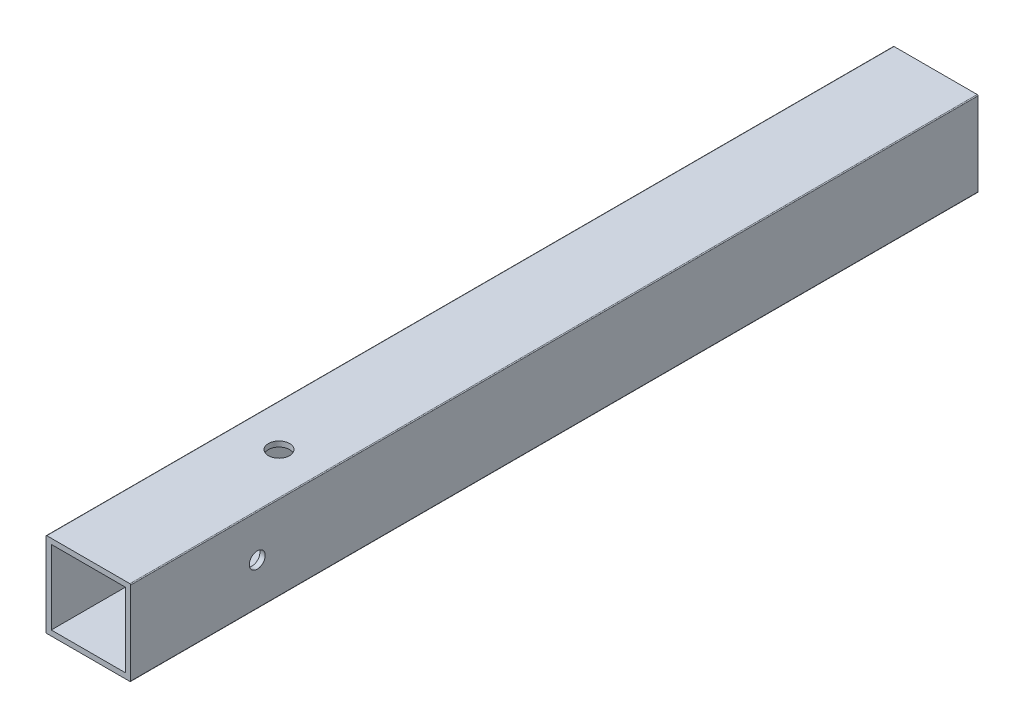
ISO-10303-21;
HEADER;
FILE_DESCRIPTION(('STEP AP214'),'2;1');
FILE_NAME('part.step','',(''),(''),'','','');
FILE_SCHEMA(('AUTOMOTIVE_DESIGN { 1 0 10303 214 1 1 1 1 }'));
ENDSEC;
DATA;
#1=APPLICATION_CONTEXT('core data for automotive mechanical design processes');
#2=APPLICATION_PROTOCOL_DEFINITION('international standard','automotive_design',2000,#1);
#3=PRODUCT_CONTEXT('',#1,'mechanical');
#4=PRODUCT('Part','Part','',(#3));
#5=PRODUCT_RELATED_PRODUCT_CATEGORY('part','',(#4));
#6=PRODUCT_DEFINITION_FORMATION('','',#4);
#7=PRODUCT_DEFINITION_CONTEXT('part definition',#1,'design');
#8=PRODUCT_DEFINITION('design','',#6,#7);
#9=PRODUCT_DEFINITION_SHAPE('','',#8);
#10=(LENGTH_UNIT() NAMED_UNIT(*) SI_UNIT(.MILLI.,.METRE.));
#11=(NAMED_UNIT(*) PLANE_ANGLE_UNIT() SI_UNIT($,.RADIAN.));
#12=(NAMED_UNIT(*) SI_UNIT($,.STERADIAN.) SOLID_ANGLE_UNIT());
#13=UNCERTAINTY_MEASURE_WITH_UNIT(LENGTH_MEASURE(1.E-05),#10,'distance_accuracy_value','');
#14=(GEOMETRIC_REPRESENTATION_CONTEXT(3) GLOBAL_UNCERTAINTY_ASSIGNED_CONTEXT((#13)) GLOBAL_UNIT_ASSIGNED_CONTEXT((#10,
#11,#12)) REPRESENTATION_CONTEXT('',''));
#15=CARTESIAN_POINT('',(0.,0.,0.));
#16=DIRECTION('',(0.,0.,1.));
#17=DIRECTION('',(1.,0.,0.));
#18=AXIS2_PLACEMENT_3D('',#15,#16,#17);
#19=CARTESIAN_POINT('',(-1.33350000000001,-1.3335,-254.));
#20=DIRECTION('',(0.,0.,1.));
#21=DIRECTION('',(-1.,0.,0.));
#22=AXIS2_PLACEMENT_3D('',#19,#20,#21);
#23=CYLINDRICAL_SURFACE('',#22,0.253999999999997);
#24=CARTESIAN_POINT('',(-1.33350000000001,-1.3335,0.));
#25=DIRECTION('',(0.,0.,-1.));
#26=DIRECTION('',(-1.,0.,0.));
#27=AXIS2_PLACEMENT_3D('',#24,#25,#26);
#28=CIRCLE('',#27,0.253999999999997);
#29=CARTESIAN_POINT('',(-1.33350000000001,-1.5875,0.));
#30=VERTEX_POINT('',#29);
#31=CARTESIAN_POINT('',(-1.5875,-1.3335,0.));
#32=VERTEX_POINT('',#31);
#33=EDGE_CURVE('E165',#30,#32,#28,.T.);
#34=ORIENTED_EDGE('',*,*,#33,.T.);
#35=DIRECTION('',(0.,0.,1.));
#36=VECTOR('',#35,1.);
#37=CARTESIAN_POINT('',(-1.5875,-1.3335,-254.));
#38=LINE('',#37,#36);
#39=CARTESIAN_POINT('',(-1.5875,-1.3335,-254.));
#40=VERTEX_POINT('',#39);
#41=EDGE_CURVE('E187',#40,#32,#38,.T.);
#42=ORIENTED_EDGE('',*,*,#41,.F.);
#43=CARTESIAN_POINT('',(-1.33350000000001,-1.3335,-254.));
#44=DIRECTION('',(0.,0.,-1.));
#45=DIRECTION('',(-1.,0.,0.));
#46=AXIS2_PLACEMENT_3D('',#43,#44,#45);
#47=CIRCLE('',#46,0.253999999999997);
#48=CARTESIAN_POINT('',(-1.33350000000001,-1.5875,-254.));
#49=VERTEX_POINT('',#48);
#50=EDGE_CURVE('E169',#49,#40,#47,.T.);
#51=ORIENTED_EDGE('',*,*,#50,.F.);
#52=DIRECTION('',(0.,0.,1.));
#53=VECTOR('',#52,1.);
#54=CARTESIAN_POINT('',(-1.33350000000001,-1.5875,-254.));
#55=LINE('',#54,#53);
#56=EDGE_CURVE('E11',#49,#30,#55,.T.);
#57=ORIENTED_EDGE('',*,*,#56,.T.);
#58=EDGE_LOOP('',(#34,#42,#51,#57));
#59=FACE_BOUND('',#58,.T.);
#60=ADVANCED_FACE('F39',(#59),#23,.T.);
#61=CARTESIAN_POINT('',(23.5585,-1.5875,-254.));
#62=DIRECTION('',(0.,-1.,0.));
#63=DIRECTION('',(1.,0.,0.));
#64=AXIS2_PLACEMENT_3D('',#61,#62,#63);
#65=PLANE('',#64);
#66=CARTESIAN_POINT('',(11.1125,-1.5875,-57.15));
#67=DIRECTION('',(0.,1.,0.));
#68=DIRECTION('',(1.,0.,0.));
#69=AXIS2_PLACEMENT_3D('',#66,#67,#68);
#70=CIRCLE('',#69,3.175);
#71=CARTESIAN_POINT('',(14.2875,-1.5875,-57.15));
#72=VERTEX_POINT('',#71);
#73=EDGE_CURVE('E233',#72,#72,#70,.T.);
#74=ORIENTED_EDGE('',*,*,#73,.T.);
#75=EDGE_LOOP('',(#74));
#76=FACE_BOUND('',#75,.T.);
#77=DIRECTION('',(-1.,0.,0.));
#78=VECTOR('',#77,1.);
#79=CARTESIAN_POINT('',(23.5585,-1.5875,0.));
#80=LINE('',#79,#78);
#81=CARTESIAN_POINT('',(23.5585,-1.5875,0.));
#82=VERTEX_POINT('',#81);
#83=EDGE_CURVE('E173',#82,#30,#80,.T.);
#84=ORIENTED_EDGE('',*,*,#83,.T.);
#85=ORIENTED_EDGE('',*,*,#56,.F.);
#86=DIRECTION('',(-1.,0.,0.));
#87=VECTOR('',#86,1.);
#88=CARTESIAN_POINT('',(23.5585,-1.5875,-254.));
#89=LINE('',#88,#87);
#90=CARTESIAN_POINT('',(23.5585,-1.5875,-254.));
#91=VERTEX_POINT('',#90);
#92=EDGE_CURVE('E185',#91,#49,#89,.T.);
#93=ORIENTED_EDGE('',*,*,#92,.F.);
#94=DIRECTION('',(0.,0.,1.));
#95=VECTOR('',#94,1.);
#96=CARTESIAN_POINT('',(23.5585,-1.5875,-254.));
#97=LINE('',#96,#95);
#98=EDGE_CURVE('E47',#91,#82,#97,.T.);
#99=ORIENTED_EDGE('',*,*,#98,.T.);
#100=EDGE_LOOP('',(#84,#85,#93,#99));
#101=FACE_BOUND('',#100,.T.);
#102=ADVANCED_FACE('F265',(#76,#101),#65,.T.);
#103=CARTESIAN_POINT('',(23.5585,-1.3335,-254.));
#104=DIRECTION('',(0.,0.,1.));
#105=DIRECTION('',(-1.,0.,0.));
#106=AXIS2_PLACEMENT_3D('',#103,#104,#105);
#107=CYLINDRICAL_SURFACE('',#106,0.253999999999998);
#108=CARTESIAN_POINT('',(23.5585,-1.3335,0.));
#109=DIRECTION('',(0.,0.,-1.));
#110=DIRECTION('',(-1.,0.,0.));
#111=AXIS2_PLACEMENT_3D('',#108,#109,#110);
#112=CIRCLE('',#111,0.253999999999998);
#113=CARTESIAN_POINT('',(23.8125,-1.3335,0.));
#114=VERTEX_POINT('',#113);
#115=EDGE_CURVE('E200',#114,#82,#112,.T.);
#116=ORIENTED_EDGE('',*,*,#115,.T.);
#117=ORIENTED_EDGE('',*,*,#98,.F.);
#118=CARTESIAN_POINT('',(23.5585,-1.3335,-254.));
#119=DIRECTION('',(0.,0.,-1.));
#120=DIRECTION('',(-1.,0.,0.));
#121=AXIS2_PLACEMENT_3D('',#118,#119,#120);
#122=CIRCLE('',#121,0.253999999999998);
#123=CARTESIAN_POINT('',(23.8125,-1.3335,-254.));
#124=VERTEX_POINT('',#123);
#125=EDGE_CURVE('E183',#124,#91,#122,.T.);
#126=ORIENTED_EDGE('',*,*,#125,.F.);
#127=DIRECTION('',(0.,0.,1.));
#128=VECTOR('',#127,1.);
#129=CARTESIAN_POINT('',(23.8125,-1.3335,-254.));
#130=LINE('',#129,#128);
#131=EDGE_CURVE('E205',#124,#114,#130,.T.);
#132=ORIENTED_EDGE('',*,*,#131,.T.);
#133=EDGE_LOOP('',(#116,#117,#126,#132));
#134=FACE_BOUND('',#133,.T.);
#135=ADVANCED_FACE('F270',(#134),#107,.T.);
#136=CARTESIAN_POINT('',(23.8125,23.5585,-254.));
#137=DIRECTION('',(1.,0.,0.));
#138=DIRECTION('',(0.,1.,0.));
#139=AXIS2_PLACEMENT_3D('',#136,#137,#138);
#140=PLANE('',#139);
#141=CARTESIAN_POINT('',(23.8125,11.1125,-37.933268304));
#142=DIRECTION('',(-1.,0.,0.));
#143=DIRECTION('',(0.,1.,0.));
#144=AXIS2_PLACEMENT_3D('',#141,#142,#143);
#145=CIRCLE('',#144,2.38125);
#146=CARTESIAN_POINT('',(23.8125,13.49375,-37.933268304));
#147=VERTEX_POINT('',#146);
#148=EDGE_CURVE('E228',#147,#147,#145,.T.);
#149=ORIENTED_EDGE('',*,*,#148,.T.);
#150=EDGE_LOOP('',(#149));
#151=FACE_BOUND('',#150,.T.);
#152=DIRECTION('',(0.,-1.,0.));
#153=VECTOR('',#152,1.);
#154=CARTESIAN_POINT('',(23.8125,23.5585,0.));
#155=LINE('',#154,#153);
#156=CARTESIAN_POINT('',(23.8125,23.5585,0.));
#157=VERTEX_POINT('',#156);
#158=EDGE_CURVE('E198',#157,#114,#155,.T.);
#159=ORIENTED_EDGE('',*,*,#158,.T.);
#160=ORIENTED_EDGE('',*,*,#131,.F.);
#161=DIRECTION('',(0.,-1.,0.));
#162=VECTOR('',#161,1.);
#163=CARTESIAN_POINT('',(23.8125,23.5585,-254.));
#164=LINE('',#163,#162);
#165=CARTESIAN_POINT('',(23.8125,23.5585,-254.));
#166=VERTEX_POINT('',#165);
#167=EDGE_CURVE('E181',#166,#124,#164,.T.);
#168=ORIENTED_EDGE('',*,*,#167,.F.);
#169=DIRECTION('',(0.,0.,1.));
#170=VECTOR('',#169,1.);
#171=CARTESIAN_POINT('',(23.8125,23.5585,-254.));
#172=LINE('',#171,#170);
#173=EDGE_CURVE('E208',#166,#157,#172,.T.);
#174=ORIENTED_EDGE('',*,*,#173,.T.);
#175=EDGE_LOOP('',(#159,#160,#168,#174));
#176=FACE_BOUND('',#175,.T.);
#177=ADVANCED_FACE('F296',(#151,#176),#140,.T.);
#178=CARTESIAN_POINT('',(23.5585,23.5585,-254.));
#179=DIRECTION('',(0.,0.,1.));
#180=DIRECTION('',(-1.,0.,0.));
#181=AXIS2_PLACEMENT_3D('',#178,#179,#180);
#182=CYLINDRICAL_SURFACE('',#181,0.254000000000001);
#183=CARTESIAN_POINT('',(23.5585,23.5585,0.));
#184=DIRECTION('',(0.,0.,-1.));
#185=DIRECTION('',(-1.,0.,0.));
#186=AXIS2_PLACEMENT_3D('',#183,#184,#185);
#187=CIRCLE('',#186,0.254000000000001);
#188=CARTESIAN_POINT('',(23.5585,23.8125,0.));
#189=VERTEX_POINT('',#188);
#190=EDGE_CURVE('E196',#189,#157,#187,.T.);
#191=ORIENTED_EDGE('',*,*,#190,.T.);
#192=ORIENTED_EDGE('',*,*,#173,.F.);
#193=CARTESIAN_POINT('',(23.5585,23.5585,-254.));
#194=DIRECTION('',(0.,0.,-1.));
#195=DIRECTION('',(-1.,0.,0.));
#196=AXIS2_PLACEMENT_3D('',#193,#194,#195);
#197=CIRCLE('',#196,0.254000000000001);
#198=CARTESIAN_POINT('',(23.5585,23.8125,-254.));
#199=VERTEX_POINT('',#198);
#200=EDGE_CURVE('E179',#199,#166,#197,.T.);
#201=ORIENTED_EDGE('',*,*,#200,.F.);
#202=DIRECTION('',(0.,0.,1.));
#203=VECTOR('',#202,1.);
#204=CARTESIAN_POINT('',(23.5585,23.8125,-254.));
#205=LINE('',#204,#203);
#206=EDGE_CURVE('E211',#199,#189,#205,.T.);
#207=ORIENTED_EDGE('',*,*,#206,.T.);
#208=EDGE_LOOP('',(#191,#192,#201,#207));
#209=FACE_BOUND('',#208,.T.);
#210=ADVANCED_FACE('F301',(#209),#182,.T.);
#211=CARTESIAN_POINT('',(-1.33350000000001,23.8125,-254.));
#212=DIRECTION('',(0.,1.,0.));
#213=DIRECTION('',(0.,0.,-1.));
#214=AXIS2_PLACEMENT_3D('',#211,#212,#213);
#215=PLANE('',#214);
#216=CARTESIAN_POINT('',(11.1125,23.8125,-57.15));
#217=DIRECTION('',(0.,-1.,0.));
#218=DIRECTION('',(0.,0.,-1.));
#219=AXIS2_PLACEMENT_3D('',#216,#217,#218);
#220=CIRCLE('',#219,3.175);
#221=CARTESIAN_POINT('',(11.1125,23.8125,-60.325));
#222=VERTEX_POINT('',#221);
#223=EDGE_CURVE('E241',#222,#222,#220,.T.);
#224=ORIENTED_EDGE('',*,*,#223,.T.);
#225=EDGE_LOOP('',(#224));
#226=FACE_BOUND('',#225,.T.);
#227=DIRECTION('',(1.,0.,0.));
#228=VECTOR('',#227,1.);
#229=CARTESIAN_POINT('',(-1.33350000000001,23.8125,0.));
#230=LINE('',#229,#228);
#231=CARTESIAN_POINT('',(-1.33350000000001,23.8125,0.));
#232=VERTEX_POINT('',#231);
#233=EDGE_CURVE('E194',#232,#189,#230,.T.);
#234=ORIENTED_EDGE('',*,*,#233,.T.);
#235=ORIENTED_EDGE('',*,*,#206,.F.);
#236=DIRECTION('',(1.,0.,0.));
#237=VECTOR('',#236,1.);
#238=CARTESIAN_POINT('',(-1.33350000000001,23.8125,-254.));
#239=LINE('',#238,#237);
#240=CARTESIAN_POINT('',(-1.33350000000001,23.8125,-254.));
#241=VERTEX_POINT('',#240);
#242=EDGE_CURVE('E177',#241,#199,#239,.T.);
#243=ORIENTED_EDGE('',*,*,#242,.F.);
#244=DIRECTION('',(0.,0.,1.));
#245=VECTOR('',#244,1.);
#246=CARTESIAN_POINT('',(-1.33350000000001,23.8125,-254.));
#247=LINE('',#246,#245);
#248=EDGE_CURVE('E214',#241,#232,#247,.T.);
#249=ORIENTED_EDGE('',*,*,#248,.T.);
#250=EDGE_LOOP('',(#234,#235,#243,#249));
#251=FACE_BOUND('',#250,.T.);
#252=ADVANCED_FACE('F305',(#226,#251),#215,.T.);
#253=CARTESIAN_POINT('',(-1.33350000000001,23.5585,-254.));
#254=DIRECTION('',(0.,0.,1.));
#255=DIRECTION('',(-1.,0.,0.));
#256=AXIS2_PLACEMENT_3D('',#253,#254,#255);
#257=CYLINDRICAL_SURFACE('',#256,0.253999999999992);
#258=CARTESIAN_POINT('',(-1.33350000000001,23.5585,0.));
#259=DIRECTION('',(0.,0.,-1.));
#260=DIRECTION('',(-1.,0.,0.));
#261=AXIS2_PLACEMENT_3D('',#258,#259,#260);
#262=CIRCLE('',#261,0.253999999999992);
#263=CARTESIAN_POINT('',(-1.5875,23.5585,0.));
#264=VERTEX_POINT('',#263);
#265=EDGE_CURVE('E192',#264,#232,#262,.T.);
#266=ORIENTED_EDGE('',*,*,#265,.T.);
#267=ORIENTED_EDGE('',*,*,#248,.F.);
#268=CARTESIAN_POINT('',(-1.33350000000001,23.5585,-254.));
#269=DIRECTION('',(0.,0.,-1.));
#270=DIRECTION('',(-1.,0.,0.));
#271=AXIS2_PLACEMENT_3D('',#268,#269,#270);
#272=CIRCLE('',#271,0.253999999999992);
#273=CARTESIAN_POINT('',(-1.5875,23.5585,-254.));
#274=VERTEX_POINT('',#273);
#275=EDGE_CURVE('E175',#274,#241,#272,.T.);
#276=ORIENTED_EDGE('',*,*,#275,.F.);
#277=DIRECTION('',(0.,0.,1.));
#278=VECTOR('',#277,1.);
#279=CARTESIAN_POINT('',(-1.5875,23.5585,-254.));
#280=LINE('',#279,#278);
#281=EDGE_CURVE('E217',#274,#264,#280,.T.);
#282=ORIENTED_EDGE('',*,*,#281,.T.);
#283=EDGE_LOOP('',(#266,#267,#276,#282));
#284=FACE_BOUND('',#283,.T.);
#285=ADVANCED_FACE('F308',(#284),#257,.T.);
#286=CARTESIAN_POINT('',(-1.5875,-1.3335,-254.));
#287=DIRECTION('',(-1.,0.,0.));
#288=DIRECTION('',(0.,-1.,0.));
#289=AXIS2_PLACEMENT_3D('',#286,#287,#288);
#290=PLANE('',#289);
#291=CARTESIAN_POINT('',(-1.58750000000001,11.1125,-37.933268304));
#292=DIRECTION('',(-1.,0.,0.));
#293=DIRECTION('',(0.,1.,0.));
#294=AXIS2_PLACEMENT_3D('',#291,#292,#293);
#295=CIRCLE('',#294,2.38125);
#296=CARTESIAN_POINT('',(-1.5875,13.49375,-37.933268304));
#297=VERTEX_POINT('',#296);
#298=EDGE_CURVE('E223',#297,#297,#295,.T.);
#299=ORIENTED_EDGE('',*,*,#298,.F.);
#300=EDGE_LOOP('',(#299));
#301=FACE_BOUND('',#300,.T.);
#302=DIRECTION('',(0.,1.,0.));
#303=VECTOR('',#302,1.);
#304=CARTESIAN_POINT('',(-1.5875,-1.3335,0.));
#305=LINE('',#304,#303);
#306=EDGE_CURVE('E190',#32,#264,#305,.T.);
#307=ORIENTED_EDGE('',*,*,#306,.T.);
#308=ORIENTED_EDGE('',*,*,#281,.F.);
#309=DIRECTION('',(0.,1.,0.));
#310=VECTOR('',#309,1.);
#311=CARTESIAN_POINT('',(-1.5875,-1.3335,-254.));
#312=LINE('',#311,#310);
#313=EDGE_CURVE('E172',#40,#274,#312,.T.);
#314=ORIENTED_EDGE('',*,*,#313,.F.);
#315=ORIENTED_EDGE('',*,*,#41,.T.);
#316=EDGE_LOOP('',(#307,#308,#314,#315));
#317=FACE_BOUND('',#316,.T.);
#318=ADVANCED_FACE('F285',(#301,#317),#290,.T.);
#319=CARTESIAN_POINT('',(-1.33350000000001,-1.3335,-254.));
#320=DIRECTION('',(0.,0.,1.));
#321=DIRECTION('',(-1.,0.,0.));
#322=AXIS2_PLACEMENT_3D('',#319,#320,#321);
#323=PLANE('',#322);
#324=DIRECTION('',(1.,0.,0.));
#325=VECTOR('',#324,1.);
#326=CARTESIAN_POINT('',(0.,22.225,-254.));
#327=LINE('',#326,#325);
#328=CARTESIAN_POINT('',(0.,22.225,-254.));
#329=VERTEX_POINT('',#328);
#330=CARTESIAN_POINT('',(22.225,22.225,-254.));
#331=VERTEX_POINT('',#330);
#332=EDGE_CURVE('E136',#329,#331,#327,.T.);
#333=ORIENTED_EDGE('',*,*,#332,.F.);
#334=DIRECTION('',(0.,1.,0.));
#335=VECTOR('',#334,1.);
#336=CARTESIAN_POINT('',(0.,22.225,-254.));
#337=LINE('',#336,#335);
#338=CARTESIAN_POINT('',(0.,0.,-254.));
#339=VERTEX_POINT('',#338);
#340=EDGE_CURVE('E149',#339,#329,#337,.T.);
#341=ORIENTED_EDGE('',*,*,#340,.F.);
#342=DIRECTION('',(-1.,0.,0.));
#343=VECTOR('',#342,1.);
#344=CARTESIAN_POINT('',(0.,0.,-254.));
#345=LINE('',#344,#343);
#346=CARTESIAN_POINT('',(22.225,0.,-254.));
#347=VERTEX_POINT('',#346);
#348=EDGE_CURVE('E131',#347,#339,#345,.T.);
#349=ORIENTED_EDGE('',*,*,#348,.F.);
#350=DIRECTION('',(0.,-1.,0.));
#351=VECTOR('',#350,1.);
#352=CARTESIAN_POINT('',(22.225,22.225,-254.));
#353=LINE('',#352,#351);
#354=EDGE_CURVE('E139',#331,#347,#353,.T.);
#355=ORIENTED_EDGE('',*,*,#354,.F.);
#356=EDGE_LOOP('',(#333,#341,#349,#355));
#357=FACE_BOUND('',#356,.T.);
#358=ORIENTED_EDGE('',*,*,#50,.T.);
#359=ORIENTED_EDGE('',*,*,#313,.T.);
#360=ORIENTED_EDGE('',*,*,#275,.T.);
#361=ORIENTED_EDGE('',*,*,#242,.T.);
#362=ORIENTED_EDGE('',*,*,#200,.T.);
#363=ORIENTED_EDGE('',*,*,#167,.T.);
#364=ORIENTED_EDGE('',*,*,#125,.T.);
#365=ORIENTED_EDGE('',*,*,#92,.T.);
#366=EDGE_LOOP('',(#358,#359,#360,#361,#362,#363,#364,#365));
#367=FACE_BOUND('',#366,.T.);
#368=ADVANCED_FACE('F147',(#357,#367),#323,.F.);
#369=CARTESIAN_POINT('',(-1.33350000000001,-1.3335,0.));
#370=DIRECTION('',(0.,0.,1.));
#371=DIRECTION('',(-1.,0.,0.));
#372=AXIS2_PLACEMENT_3D('',#369,#370,#371);
#373=PLANE('',#372);
#374=DIRECTION('',(0.,-1.,0.));
#375=VECTOR('',#374,1.);
#376=CARTESIAN_POINT('',(22.225,22.225,0.));
#377=LINE('',#376,#375);
#378=CARTESIAN_POINT('',(22.225,22.225,0.));
#379=VERTEX_POINT('',#378);
#380=CARTESIAN_POINT('',(22.225,0.,0.));
#381=VERTEX_POINT('',#380);
#382=EDGE_CURVE('E155',#379,#381,#377,.T.);
#383=ORIENTED_EDGE('',*,*,#382,.T.);
#384=DIRECTION('',(-1.,0.,0.));
#385=VECTOR('',#384,1.);
#386=CARTESIAN_POINT('',(0.,0.,0.));
#387=LINE('',#386,#385);
#388=CARTESIAN_POINT('',(0.,0.,0.));
#389=VERTEX_POINT('',#388);
#390=EDGE_CURVE('E134',#381,#389,#387,.T.);
#391=ORIENTED_EDGE('',*,*,#390,.T.);
#392=DIRECTION('',(0.,1.,0.));
#393=VECTOR('',#392,1.);
#394=CARTESIAN_POINT('',(0.,22.225,0.));
#395=LINE('',#394,#393);
#396=CARTESIAN_POINT('',(0.,22.225,0.));
#397=VERTEX_POINT('',#396);
#398=EDGE_CURVE('E159',#389,#397,#395,.T.);
#399=ORIENTED_EDGE('',*,*,#398,.T.);
#400=DIRECTION('',(1.,0.,0.));
#401=VECTOR('',#400,1.);
#402=CARTESIAN_POINT('',(0.,22.225,0.));
#403=LINE('',#402,#401);
#404=EDGE_CURVE('E145',#397,#379,#403,.T.);
#405=ORIENTED_EDGE('',*,*,#404,.T.);
#406=EDGE_LOOP('',(#383,#391,#399,#405));
#407=FACE_BOUND('',#406,.T.);
#408=ORIENTED_EDGE('',*,*,#33,.F.);
#409=ORIENTED_EDGE('',*,*,#83,.F.);
#410=ORIENTED_EDGE('',*,*,#115,.F.);
#411=ORIENTED_EDGE('',*,*,#158,.F.);
#412=ORIENTED_EDGE('',*,*,#190,.F.);
#413=ORIENTED_EDGE('',*,*,#233,.F.);
#414=ORIENTED_EDGE('',*,*,#265,.F.);
#415=ORIENTED_EDGE('',*,*,#306,.F.);
#416=EDGE_LOOP('',(#408,#409,#410,#411,#412,#413,#414,#415));
#417=FACE_BOUND('',#416,.T.);
#418=ADVANCED_FACE('F279',(#407,#417),#373,.T.);
#419=CARTESIAN_POINT('',(22.225,22.225,-254.));
#420=DIRECTION('',(1.,0.,0.));
#421=DIRECTION('',(0.,1.,0.));
#422=AXIS2_PLACEMENT_3D('',#419,#420,#421);
#423=PLANE('',#422);
#424=CARTESIAN_POINT('',(22.225,11.1125,-37.933268304));
#425=DIRECTION('',(-1.,0.,0.));
#426=DIRECTION('',(0.,1.,0.));
#427=AXIS2_PLACEMENT_3D('',#424,#425,#426);
#428=CIRCLE('',#427,2.38125);
#429=CARTESIAN_POINT('',(22.225,13.49375,-37.933268304));
#430=VERTEX_POINT('',#429);
#431=EDGE_CURVE('E157',#430,#430,#428,.T.);
#432=ORIENTED_EDGE('',*,*,#431,.F.);
#433=EDGE_LOOP('',(#432));
#434=FACE_BOUND('',#433,.T.);
#435=ORIENTED_EDGE('',*,*,#382,.F.);
#436=DIRECTION('',(0.,0.,1.));
#437=VECTOR('',#436,1.);
#438=CARTESIAN_POINT('',(22.225,22.225,-254.));
#439=LINE('',#438,#437);
#440=EDGE_CURVE('E141',#331,#379,#439,.T.);
#441=ORIENTED_EDGE('',*,*,#440,.F.);
#442=ORIENTED_EDGE('',*,*,#354,.T.);
#443=DIRECTION('',(0.,0.,1.));
#444=VECTOR('',#443,1.);
#445=CARTESIAN_POINT('',(22.225,0.,-254.));
#446=LINE('',#445,#444);
#447=EDGE_CURVE('E63',#347,#381,#446,.T.);
#448=ORIENTED_EDGE('',*,*,#447,.T.);
#449=EDGE_LOOP('',(#435,#441,#442,#448));
#450=FACE_BOUND('',#449,.T.);
#451=ADVANCED_FACE('F140',(#434,#450),#423,.F.);
#452=CARTESIAN_POINT('',(0.,22.225,-254.));
#453=DIRECTION('',(0.,1.,0.));
#454=DIRECTION('',(-1.,0.,0.));
#455=AXIS2_PLACEMENT_3D('',#452,#453,#454);
#456=PLANE('',#455);
#457=CARTESIAN_POINT('',(11.1125,22.225,-57.15));
#458=DIRECTION('',(0.,-1.,0.));
#459=DIRECTION('',(-1.,0.,0.));
#460=AXIS2_PLACEMENT_3D('',#457,#458,#459);
#461=CIRCLE('',#460,3.175);
#462=CARTESIAN_POINT('',(7.9375,22.225,-57.15));
#463=VERTEX_POINT('',#462);
#464=EDGE_CURVE('E238',#463,#463,#461,.T.);
#465=ORIENTED_EDGE('',*,*,#464,.F.);
#466=EDGE_LOOP('',(#465));
#467=FACE_BOUND('',#466,.T.);
#468=ORIENTED_EDGE('',*,*,#404,.F.);
#469=DIRECTION('',(0.,0.,1.));
#470=VECTOR('',#469,1.);
#471=CARTESIAN_POINT('',(0.,22.225,-254.));
#472=LINE('',#471,#470);
#473=EDGE_CURVE('E166',#329,#397,#472,.T.);
#474=ORIENTED_EDGE('',*,*,#473,.F.);
#475=ORIENTED_EDGE('',*,*,#332,.T.);
#476=ORIENTED_EDGE('',*,*,#440,.T.);
#477=EDGE_LOOP('',(#468,#474,#475,#476));
#478=FACE_BOUND('',#477,.T.);
#479=ADVANCED_FACE('F260',(#467,#478),#456,.F.);
#480=CARTESIAN_POINT('',(0.,22.225,-254.));
#481=DIRECTION('',(-1.,0.,0.));
#482=DIRECTION('',(0.,-1.,0.));
#483=AXIS2_PLACEMENT_3D('',#480,#481,#482);
#484=PLANE('',#483);
#485=CARTESIAN_POINT('',(0.,11.1125,-37.933268304));
#486=DIRECTION('',(1.,0.,0.));
#487=DIRECTION('',(0.,-1.,0.));
#488=AXIS2_PLACEMENT_3D('',#485,#486,#487);
#489=CIRCLE('',#488,2.38125);
#490=CARTESIAN_POINT('',(0.,13.49375,-37.933268304));
#491=VERTEX_POINT('',#490);
#492=EDGE_CURVE('E221',#491,#491,#489,.T.);
#493=ORIENTED_EDGE('',*,*,#492,.F.);
#494=EDGE_LOOP('',(#493));
#495=FACE_BOUND('',#494,.T.);
#496=ORIENTED_EDGE('',*,*,#398,.F.);
#497=DIRECTION('',(0.,0.,1.));
#498=VECTOR('',#497,1.);
#499=CARTESIAN_POINT('',(0.,0.,-254.));
#500=LINE('',#499,#498);
#501=EDGE_CURVE('E55',#339,#389,#500,.T.);
#502=ORIENTED_EDGE('',*,*,#501,.F.);
#503=ORIENTED_EDGE('',*,*,#340,.T.);
#504=ORIENTED_EDGE('',*,*,#473,.T.);
#505=EDGE_LOOP('',(#496,#502,#503,#504));
#506=FACE_BOUND('',#505,.T.);
#507=ADVANCED_FACE('F252',(#495,#506),#484,.F.);
#508=CARTESIAN_POINT('',(0.,0.,-254.));
#509=DIRECTION('',(0.,-1.,0.));
#510=DIRECTION('',(1.,0.,0.));
#511=AXIS2_PLACEMENT_3D('',#508,#509,#510);
#512=PLANE('',#511);
#513=CARTESIAN_POINT('',(11.1125,0.,-57.15));
#514=DIRECTION('',(0.,1.,0.));
#515=DIRECTION('',(1.,0.,0.));
#516=AXIS2_PLACEMENT_3D('',#513,#514,#515);
#517=CIRCLE('',#516,3.175);
#518=CARTESIAN_POINT('',(14.2875,0.,-57.15));
#519=VERTEX_POINT('',#518);
#520=EDGE_CURVE('E42',#519,#519,#517,.T.);
#521=ORIENTED_EDGE('',*,*,#520,.F.);
#522=EDGE_LOOP('',(#521));
#523=FACE_BOUND('',#522,.T.);
#524=ORIENTED_EDGE('',*,*,#390,.F.);
#525=ORIENTED_EDGE('',*,*,#447,.F.);
#526=ORIENTED_EDGE('',*,*,#348,.T.);
#527=ORIENTED_EDGE('',*,*,#501,.T.);
#528=EDGE_LOOP('',(#524,#525,#526,#527));
#529=FACE_BOUND('',#528,.T.);
#530=ADVANCED_FACE('F129',(#523,#529),#512,.F.);
#531=CARTESIAN_POINT('',(-1.58750000000001,11.1125,-37.933268304));
#532=DIRECTION('',(1.,0.,0.));
#533=DIRECTION('',(0.,1.,0.));
#534=AXIS2_PLACEMENT_3D('',#531,#532,#533);
#535=CYLINDRICAL_SURFACE('',#534,2.38125);
#536=CARTESIAN_POINT('',(-1.5875,13.49375,-37.933268304));
#537=CARTESIAN_POINT('',(-1.57096354166667,13.49375,-37.933268304));
#538=CARTESIAN_POINT('',(-1.55442708333334,13.49375,-37.933268304));
#539=CARTESIAN_POINT('',(-1.52135416666667,13.49375,-37.933268304));
#540=CARTESIAN_POINT('',(-1.50481770833334,13.49375,-37.933268304));
#541=CARTESIAN_POINT('',(-1.47174479166667,13.49375,-37.933268304));
#542=CARTESIAN_POINT('',(-1.45520833333334,13.49375,-37.933268304));
#543=CARTESIAN_POINT('',(-1.42213541666667,13.49375,-37.933268304));
#544=CARTESIAN_POINT('',(-1.40559895833334,13.49375,-37.933268304));
#545=CARTESIAN_POINT('',(-1.37252604166667,13.49375,-37.933268304));
#546=CARTESIAN_POINT('',(-1.35598958333334,13.49375,-37.933268304));
#547=CARTESIAN_POINT('',(-1.32291666666667,13.49375,-37.933268304));
#548=CARTESIAN_POINT('',(-1.30638020833334,13.49375,-37.933268304));
#549=CARTESIAN_POINT('',(-1.27330729166667,13.49375,-37.933268304));
#550=CARTESIAN_POINT('',(-1.25677083333334,13.49375,-37.933268304));
#551=CARTESIAN_POINT('',(-1.22369791666667,13.49375,-37.933268304));
#552=CARTESIAN_POINT('',(-1.20716145833334,13.49375,-37.933268304));
#553=CARTESIAN_POINT('',(-1.17408854166667,13.49375,-37.933268304));
#554=CARTESIAN_POINT('',(-1.15755208333334,13.49375,-37.933268304));
#555=CARTESIAN_POINT('',(-1.12447916666667,13.49375,-37.933268304));
#556=CARTESIAN_POINT('',(-1.10794270833334,13.49375,-37.933268304));
#557=CARTESIAN_POINT('',(-1.07486979166667,13.49375,-37.933268304));
#558=CARTESIAN_POINT('',(-1.05833333333334,13.49375,-37.933268304));
#559=CARTESIAN_POINT('',(-1.02526041666667,13.49375,-37.933268304));
#560=CARTESIAN_POINT('',(-1.00872395833334,13.49375,-37.933268304));
#561=CARTESIAN_POINT('',(-0.975651041666671,13.49375,-37.933268304));
#562=CARTESIAN_POINT('',(-0.959114583333337,13.49375,-37.933268304));
#563=CARTESIAN_POINT('',(-0.926041666666671,13.49375,-37.933268304));
#564=CARTESIAN_POINT('',(-0.909505208333337,13.49375,-37.933268304));
#565=CARTESIAN_POINT('',(-0.876432291666671,13.49375,-37.933268304));
#566=CARTESIAN_POINT('',(-0.859895833333337,13.49375,-37.933268304));
#567=CARTESIAN_POINT('',(-0.826822916666671,13.49375,-37.933268304));
#568=CARTESIAN_POINT('',(-0.810286458333337,13.49375,-37.933268304));
#569=CARTESIAN_POINT('',(-0.777213541666671,13.49375,-37.933268304));
#570=CARTESIAN_POINT('',(-0.760677083333337,13.49375,-37.933268304));
#571=CARTESIAN_POINT('',(-0.727604166666671,13.49375,-37.933268304));
#572=CARTESIAN_POINT('',(-0.711067708333337,13.49375,-37.933268304));
#573=CARTESIAN_POINT('',(-0.677994791666671,13.49375,-37.933268304));
#574=CARTESIAN_POINT('',(-0.661458333333337,13.49375,-37.933268304));
#575=CARTESIAN_POINT('',(-0.628385416666671,13.49375,-37.933268304));
#576=CARTESIAN_POINT('',(-0.611848958333337,13.49375,-37.933268304));
#577=CARTESIAN_POINT('',(-0.578776041666671,13.49375,-37.933268304));
#578=CARTESIAN_POINT('',(-0.562239583333337,13.49375,-37.933268304));
#579=CARTESIAN_POINT('',(-0.529166666666671,13.49375,-37.933268304));
#580=CARTESIAN_POINT('',(-0.512630208333337,13.49375,-37.933268304));
#581=CARTESIAN_POINT('',(-0.479557291666671,13.49375,-37.933268304));
#582=CARTESIAN_POINT('',(-0.463020833333337,13.49375,-37.933268304));
#583=CARTESIAN_POINT('',(-0.429947916666671,13.49375,-37.933268304));
#584=CARTESIAN_POINT('',(-0.413411458333337,13.49375,-37.933268304));
#585=CARTESIAN_POINT('',(-0.38033854166667,13.49375,-37.933268304));
#586=CARTESIAN_POINT('',(-0.363802083333337,13.49375,-37.933268304));
#587=CARTESIAN_POINT('',(-0.33072916666667,13.49375,-37.933268304));
#588=CARTESIAN_POINT('',(-0.314192708333337,13.49375,-37.933268304));
#589=CARTESIAN_POINT('',(-0.28111979166667,13.49375,-37.933268304));
#590=CARTESIAN_POINT('',(-0.264583333333337,13.49375,-37.933268304));
#591=CARTESIAN_POINT('',(-0.23151041666667,13.49375,-37.933268304));
#592=CARTESIAN_POINT('',(-0.214973958333337,13.49375,-37.933268304));
#593=CARTESIAN_POINT('',(-0.18190104166667,13.49375,-37.933268304));
#594=CARTESIAN_POINT('',(-0.165364583333337,13.49375,-37.933268304));
#595=CARTESIAN_POINT('',(-0.13229166666667,13.49375,-37.933268304));
#596=CARTESIAN_POINT('',(-0.115755208333337,13.49375,-37.933268304));
#597=CARTESIAN_POINT('',(-0.0826822916666702,13.49375,-37.933268304));
#598=CARTESIAN_POINT('',(-0.0661458333333368,13.49375,-37.933268304));
#599=CARTESIAN_POINT('',(-0.0330729166666701,13.49375,-37.933268304));
#600=CARTESIAN_POINT('',(-0.0165364583333368,13.49375,-37.933268304));
#601=CARTESIAN_POINT('',(0.,13.49375,-37.933268304));
#602=B_SPLINE_CURVE_WITH_KNOTS('',3,(#536,#537,#538,#539,#540,#541,#542,#543,#544,#545,#546,
#547,#548,#549,#550,#551,#552,#553,#554,#555,#556,#557,#558,#559,#560,#561,#562,#563,#564,#565,
#566,#567,#568,#569,#570,#571,#572,#573,#574,#575,#576,#577,#578,#579,#580,#581,#582,#583,#584,
#585,#586,#587,#588,#589,#590,#591,#592,#593,#594,#595,#596,#597,#598,#599,#600,#601),
.UNSPECIFIED.,.F.,.F.,(4,2,2,2,2,2,2,2,2,2,2,2,2,2,2,2,2,2,2,2,2,2,2,2,2,2,2,2,2,2,2,2,4),(0.,
0.0496093750000002,0.0992187500000001,0.148828125,0.1984375,0.248046875,0.29765625,0.347265625,
0.396875000000001,0.446484375,0.49609375,0.545703125000001,0.595312500000001,0.644921875000001,
0.694531250000001,0.744140625000001,0.793750000000001,0.843359375000001,0.892968750000001,
0.942578125000001,0.992187500000001,1.041796875,1.09140625,1.141015625,1.190625,1.240234375,
1.28984375,1.339453125,1.3890625,1.438671875,1.48828125,1.537890625,1.5875),.UNSPECIFIED.);
#603=EDGE_CURVE('BSEAM251',#297,#491,#602,.T.);
#604=ORIENTED_EDGE('',*,*,#298,.T.);
#605=ORIENTED_EDGE('',*,*,#492,.T.);
#606=ORIENTED_EDGE('',*,*,#603,.T.);
#607=ORIENTED_EDGE('',*,*,#603,.F.);
#608=EDGE_LOOP('',(#604,#606,#605,#607));
#609=FACE_BOUND('',#608,.T.);
#610=ADVANCED_FACE('F251',(#609),#535,.F.);
#611=CARTESIAN_POINT('',(23.8125,13.49375,-37.933268304));
#612=CARTESIAN_POINT('',(23.7959635416667,13.49375,-37.933268304));
#613=CARTESIAN_POINT('',(23.7794270833333,13.49375,-37.933268304));
#614=CARTESIAN_POINT('',(23.7463541666667,13.49375,-37.933268304));
#615=CARTESIAN_POINT('',(23.7298177083333,13.49375,-37.933268304));
#616=CARTESIAN_POINT('',(23.6967447916667,13.49375,-37.933268304));
#617=CARTESIAN_POINT('',(23.6802083333333,13.49375,-37.933268304));
#618=CARTESIAN_POINT('',(23.6471354166667,13.49375,-37.933268304));
#619=CARTESIAN_POINT('',(23.6305989583333,13.49375,-37.933268304));
#620=CARTESIAN_POINT('',(23.5975260416667,13.49375,-37.933268304));
#621=CARTESIAN_POINT('',(23.5809895833333,13.49375,-37.933268304));
#622=CARTESIAN_POINT('',(23.5479166666667,13.49375,-37.933268304));
#623=CARTESIAN_POINT('',(23.5313802083333,13.49375,-37.933268304));
#624=CARTESIAN_POINT('',(23.4983072916667,13.49375,-37.933268304));
#625=CARTESIAN_POINT('',(23.4817708333333,13.49375,-37.933268304));
#626=CARTESIAN_POINT('',(23.4486979166667,13.49375,-37.933268304));
#627=CARTESIAN_POINT('',(23.4321614583333,13.49375,-37.933268304));
#628=CARTESIAN_POINT('',(23.3990885416667,13.49375,-37.933268304));
#629=CARTESIAN_POINT('',(23.3825520833333,13.49375,-37.933268304));
#630=CARTESIAN_POINT('',(23.3494791666667,13.49375,-37.933268304));
#631=CARTESIAN_POINT('',(23.3329427083333,13.49375,-37.933268304));
#632=CARTESIAN_POINT('',(23.2998697916667,13.49375,-37.933268304));
#633=CARTESIAN_POINT('',(23.2833333333333,13.49375,-37.933268304));
#634=CARTESIAN_POINT('',(23.2502604166667,13.49375,-37.933268304));
#635=CARTESIAN_POINT('',(23.2337239583333,13.49375,-37.933268304));
#636=CARTESIAN_POINT('',(23.2006510416667,13.49375,-37.933268304));
#637=CARTESIAN_POINT('',(23.1841145833333,13.49375,-37.933268304));
#638=CARTESIAN_POINT('',(23.1510416666667,13.49375,-37.933268304));
#639=CARTESIAN_POINT('',(23.1345052083333,13.49375,-37.933268304));
#640=CARTESIAN_POINT('',(23.1014322916667,13.49375,-37.933268304));
#641=CARTESIAN_POINT('',(23.0848958333333,13.49375,-37.933268304));
#642=CARTESIAN_POINT('',(23.0518229166667,13.49375,-37.933268304));
#643=CARTESIAN_POINT('',(23.0352864583333,13.49375,-37.933268304));
#644=CARTESIAN_POINT('',(23.0022135416667,13.49375,-37.933268304));
#645=CARTESIAN_POINT('',(22.9856770833333,13.49375,-37.933268304));
#646=CARTESIAN_POINT('',(22.9526041666667,13.49375,-37.933268304));
#647=CARTESIAN_POINT('',(22.9360677083333,13.49375,-37.933268304));
#648=CARTESIAN_POINT('',(22.9029947916667,13.49375,-37.933268304));
#649=CARTESIAN_POINT('',(22.8864583333333,13.49375,-37.933268304));
#650=CARTESIAN_POINT('',(22.8533854166667,13.49375,-37.933268304));
#651=CARTESIAN_POINT('',(22.8368489583333,13.49375,-37.933268304));
#652=CARTESIAN_POINT('',(22.8037760416667,13.49375,-37.933268304));
#653=CARTESIAN_POINT('',(22.7872395833333,13.49375,-37.933268304));
#654=CARTESIAN_POINT('',(22.7541666666667,13.49375,-37.933268304));
#655=CARTESIAN_POINT('',(22.7376302083333,13.49375,-37.933268304));
#656=CARTESIAN_POINT('',(22.7045572916667,13.49375,-37.933268304));
#657=CARTESIAN_POINT('',(22.6880208333333,13.49375,-37.933268304));
#658=CARTESIAN_POINT('',(22.6549479166667,13.49375,-37.933268304));
#659=CARTESIAN_POINT('',(22.6384114583333,13.49375,-37.933268304));
#660=CARTESIAN_POINT('',(22.6053385416667,13.49375,-37.933268304));
#661=CARTESIAN_POINT('',(22.5888020833333,13.49375,-37.933268304));
#662=CARTESIAN_POINT('',(22.5557291666667,13.49375,-37.933268304));
#663=CARTESIAN_POINT('',(22.5391927083333,13.49375,-37.933268304));
#664=CARTESIAN_POINT('',(22.5061197916667,13.49375,-37.933268304));
#665=CARTESIAN_POINT('',(22.4895833333333,13.49375,-37.933268304));
#666=CARTESIAN_POINT('',(22.4565104166667,13.49375,-37.933268304));
#667=CARTESIAN_POINT('',(22.4399739583333,13.49375,-37.933268304));
#668=CARTESIAN_POINT('',(22.4069010416667,13.49375,-37.933268304));
#669=CARTESIAN_POINT('',(22.3903645833333,13.49375,-37.933268304));
#670=CARTESIAN_POINT('',(22.3572916666667,13.49375,-37.933268304));
#671=CARTESIAN_POINT('',(22.3407552083333,13.49375,-37.933268304));
#672=CARTESIAN_POINT('',(22.3076822916667,13.49375,-37.933268304));
#673=CARTESIAN_POINT('',(22.2911458333333,13.49375,-37.933268304));
#674=CARTESIAN_POINT('',(22.2580729166667,13.49375,-37.933268304));
#675=CARTESIAN_POINT('',(22.2415364583333,13.49375,-37.933268304));
#676=CARTESIAN_POINT('',(22.225,13.49375,-37.933268304));
#677=B_SPLINE_CURVE_WITH_KNOTS('',3,(#611,#612,#613,#614,#615,#616,#617,#618,#619,#620,#621,
#622,#623,#624,#625,#626,#627,#628,#629,#630,#631,#632,#633,#634,#635,#636,#637,#638,#639,#640,
#641,#642,#643,#644,#645,#646,#647,#648,#649,#650,#651,#652,#653,#654,#655,#656,#657,#658,#659,
#660,#661,#662,#663,#664,#665,#666,#667,#668,#669,#670,#671,#672,#673,#674,#675,#676),
.UNSPECIFIED.,.F.,.F.,(4,2,2,2,2,2,2,2,2,2,2,2,2,2,2,2,2,2,2,2,2,2,2,2,2,2,2,2,2,2,2,2,4),(0.,
0.0496093749999989,0.0992187499999977,0.148828125,0.198437499999999,0.248046874999998,
0.29765625,0.347265624999999,0.396874999999998,0.446484374999997,0.496093749999996,
0.545703124999998,0.595312499999997,0.644921874999996,0.694531249999998,0.744140624999997,
0.793749999999996,0.843359374999995,0.892968749999994,0.942578124999996,0.992187499999995,
1.04179687499999,1.09140625,1.14101562499999,1.19062499999999,1.24023437499999,1.28984374999999,
1.33945312499999,1.38906249999999,1.43867187499999,1.48828124999999,1.53789062499999,
1.58749999999999),.UNSPECIFIED.);
#678=EDGE_CURVE('BSEAM258',#147,#430,#677,.T.);
#679=ORIENTED_EDGE('',*,*,#148,.F.);
#680=ORIENTED_EDGE('',*,*,#431,.T.);
#681=ORIENTED_EDGE('',*,*,#678,.T.);
#682=ORIENTED_EDGE('',*,*,#678,.F.);
#683=EDGE_LOOP('',(#679,#681,#680,#682));
#684=FACE_BOUND('',#683,.T.);
#685=ADVANCED_FACE('F258',(#684),#535,.F.);
#686=CARTESIAN_POINT('',(11.1125,-26.9875,-57.15));
#687=DIRECTION('',(0.,1.,0.));
#688=DIRECTION('',(0.,0.,-1.));
#689=AXIS2_PLACEMENT_3D('',#686,#687,#688);
#690=CYLINDRICAL_SURFACE('',#689,3.175);
#691=ORIENTED_EDGE('',*,*,#73,.F.);
#692=EDGE_LOOP('',(#691));
#693=FACE_BOUND('',#692,.T.);
#694=ORIENTED_EDGE('',*,*,#520,.T.);
#695=EDGE_LOOP('',(#694));
#696=FACE_BOUND('',#695,.T.);
#697=ADVANCED_FACE('F248',(#693,#696),#690,.F.);
#698=ORIENTED_EDGE('',*,*,#223,.F.);
#699=EDGE_LOOP('',(#698));
#700=FACE_BOUND('',#699,.T.);
#701=ORIENTED_EDGE('',*,*,#464,.T.);
#702=EDGE_LOOP('',(#701));
#703=FACE_BOUND('',#702,.T.);
#704=ADVANCED_FACE('F343',(#700,#703),#690,.F.);
#705=CLOSED_SHELL('',(#60,#102,#135,#177,#210,#252,#285,#318,#368,#418,#451,#479,#507,#530,#610,
#685,#697,#704));
#706=MANIFOLD_SOLID_BREP('B2',#705);
#707=ADVANCED_BREP_SHAPE_REPRESENTATION('',(#18,#706),#14);
#708=SHAPE_DEFINITION_REPRESENTATION(#9,#707);
ENDSEC;
END-ISO-10303-21;
